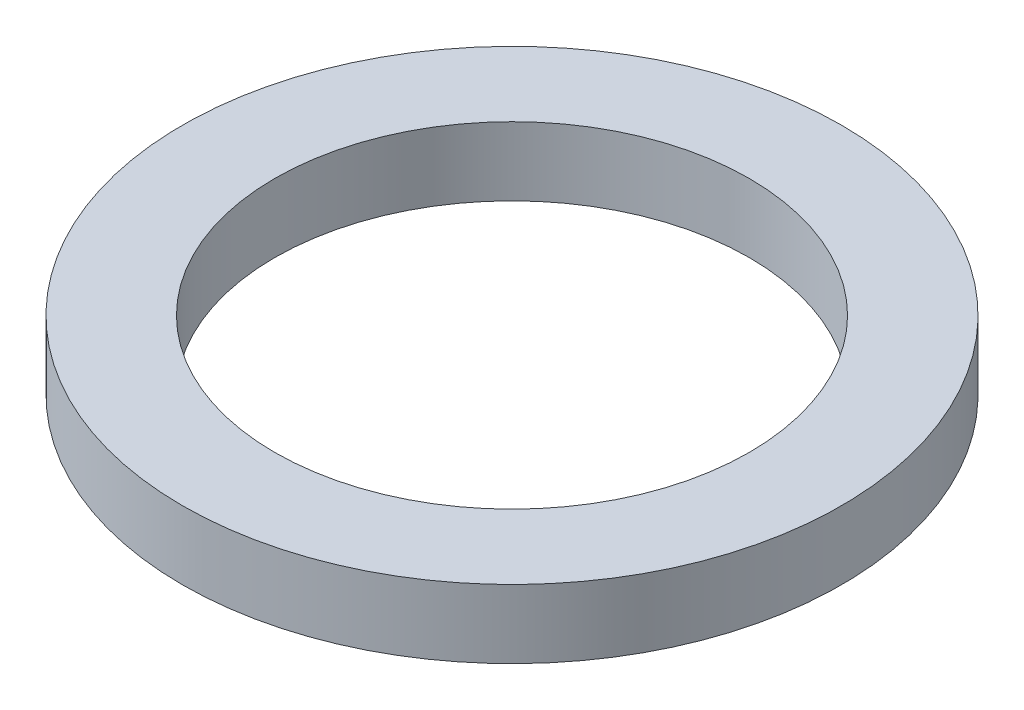
ISO-10303-21;
HEADER;
FILE_DESCRIPTION(('STEP AP214'),'2;1');
FILE_NAME('part.step','',(''),(''),'','','');
FILE_SCHEMA(('AUTOMOTIVE_DESIGN { 1 0 10303 214 1 1 1 1 }'));
ENDSEC;
DATA;
#1=APPLICATION_CONTEXT('core data for automotive mechanical design processes');
#2=APPLICATION_PROTOCOL_DEFINITION('international standard','automotive_design',2000,#1);
#3=PRODUCT_CONTEXT('',#1,'mechanical');
#4=PRODUCT('Part','Part','',(#3));
#5=PRODUCT_RELATED_PRODUCT_CATEGORY('part','',(#4));
#6=PRODUCT_DEFINITION_FORMATION('','',#4);
#7=PRODUCT_DEFINITION_CONTEXT('part definition',#1,'design');
#8=PRODUCT_DEFINITION('design','',#6,#7);
#9=PRODUCT_DEFINITION_SHAPE('','',#8);
#10=(LENGTH_UNIT() NAMED_UNIT(*) SI_UNIT(.MILLI.,.METRE.));
#11=(NAMED_UNIT(*) PLANE_ANGLE_UNIT() SI_UNIT($,.RADIAN.));
#12=(NAMED_UNIT(*) SI_UNIT($,.STERADIAN.) SOLID_ANGLE_UNIT());
#13=UNCERTAINTY_MEASURE_WITH_UNIT(LENGTH_MEASURE(1.E-05),#10,'distance_accuracy_value','');
#14=(GEOMETRIC_REPRESENTATION_CONTEXT(3) GLOBAL_UNCERTAINTY_ASSIGNED_CONTEXT((#13)) GLOBAL_UNIT_ASSIGNED_CONTEXT((#10,
#11,#12)) REPRESENTATION_CONTEXT('',''));
#15=CARTESIAN_POINT('',(0.,0.,0.));
#16=DIRECTION('',(0.,0.,1.));
#17=DIRECTION('',(1.,0.,0.));
#18=AXIS2_PLACEMENT_3D('',#15,#16,#17);
#19=CARTESIAN_POINT('',(0.,13.,0.));
#20=DIRECTION('',(0.,-1.,0.));
#21=DIRECTION('',(0.,0.,-1.));
#22=AXIS2_PLACEMENT_3D('',#19,#20,#21);
#23=CYLINDRICAL_SURFACE('',#22,62.5);
#24=CARTESIAN_POINT('',(0.,13.,0.));
#25=DIRECTION('',(0.,1.,0.));
#26=DIRECTION('',(0.,0.,1.));
#27=AXIS2_PLACEMENT_3D('',#24,#25,#26);
#28=CIRCLE('',#27,62.5);
#29=CARTESIAN_POINT('',(0.,13.,-62.5));
#30=VERTEX_POINT('',#29);
#31=EDGE_CURVE('E10',#30,#30,#28,.T.);
#32=CARTESIAN_POINT('',(0.,0.,0.));
#33=DIRECTION('',(0.,1.,0.));
#34=DIRECTION('',(0.,0.,1.));
#35=AXIS2_PLACEMENT_3D('',#32,#33,#34);
#36=CIRCLE('',#35,62.5);
#37=CARTESIAN_POINT('',(0.,0.,-62.5));
#38=VERTEX_POINT('',#37);
#39=EDGE_CURVE('E37',#38,#38,#36,.T.);
#40=CARTESIAN_POINT('',(0.,13.,-62.5));
#41=CARTESIAN_POINT('',(0.,12.8645833333333,-62.5));
#42=CARTESIAN_POINT('',(0.,12.7291666666667,-62.5));
#43=CARTESIAN_POINT('',(0.,12.4583333333333,-62.5));
#44=CARTESIAN_POINT('',(0.,12.3229166666667,-62.5));
#45=CARTESIAN_POINT('',(0.,12.0520833333333,-62.5));
#46=CARTESIAN_POINT('',(0.,11.9166666666667,-62.5));
#47=CARTESIAN_POINT('',(0.,11.6458333333333,-62.5));
#48=CARTESIAN_POINT('',(0.,11.5104166666667,-62.5));
#49=CARTESIAN_POINT('',(0.,11.2395833333333,-62.5));
#50=CARTESIAN_POINT('',(0.,11.1041666666667,-62.5));
#51=CARTESIAN_POINT('',(0.,10.8333333333333,-62.5));
#52=CARTESIAN_POINT('',(0.,10.6979166666667,-62.5));
#53=CARTESIAN_POINT('',(0.,10.4270833333333,-62.5));
#54=CARTESIAN_POINT('',(0.,10.2916666666667,-62.5));
#55=CARTESIAN_POINT('',(0.,10.0208333333333,-62.5));
#56=CARTESIAN_POINT('',(0.,9.88541666666667,-62.5));
#57=CARTESIAN_POINT('',(0.,9.61458333333333,-62.5));
#58=CARTESIAN_POINT('',(0.,9.47916666666667,-62.5));
#59=CARTESIAN_POINT('',(0.,9.20833333333333,-62.5));
#60=CARTESIAN_POINT('',(0.,9.07291666666667,-62.5));
#61=CARTESIAN_POINT('',(0.,8.80208333333333,-62.5));
#62=CARTESIAN_POINT('',(0.,8.66666666666667,-62.5));
#63=CARTESIAN_POINT('',(0.,8.39583333333333,-62.5));
#64=CARTESIAN_POINT('',(0.,8.26041666666667,-62.5));
#65=CARTESIAN_POINT('',(0.,7.98958333333333,-62.5));
#66=CARTESIAN_POINT('',(0.,7.85416666666667,-62.5));
#67=CARTESIAN_POINT('',(0.,7.58333333333333,-62.5));
#68=CARTESIAN_POINT('',(0.,7.44791666666667,-62.5));
#69=CARTESIAN_POINT('',(0.,7.17708333333333,-62.5));
#70=CARTESIAN_POINT('',(0.,7.04166666666667,-62.5));
#71=CARTESIAN_POINT('',(0.,6.77083333333333,-62.5));
#72=CARTESIAN_POINT('',(0.,6.63541666666667,-62.5));
#73=CARTESIAN_POINT('',(0.,6.36458333333333,-62.5));
#74=CARTESIAN_POINT('',(0.,6.22916666666667,-62.5));
#75=CARTESIAN_POINT('',(0.,5.95833333333333,-62.5));
#76=CARTESIAN_POINT('',(0.,5.82291666666667,-62.5));
#77=CARTESIAN_POINT('',(0.,5.55208333333333,-62.5));
#78=CARTESIAN_POINT('',(0.,5.41666666666667,-62.5));
#79=CARTESIAN_POINT('',(0.,5.14583333333333,-62.5));
#80=CARTESIAN_POINT('',(0.,5.01041666666667,-62.5));
#81=CARTESIAN_POINT('',(0.,4.73958333333333,-62.5));
#82=CARTESIAN_POINT('',(0.,4.60416666666667,-62.5));
#83=CARTESIAN_POINT('',(0.,4.33333333333333,-62.5));
#84=CARTESIAN_POINT('',(0.,4.19791666666667,-62.5));
#85=CARTESIAN_POINT('',(0.,3.92708333333333,-62.5));
#86=CARTESIAN_POINT('',(0.,3.79166666666667,-62.5));
#87=CARTESIAN_POINT('',(0.,3.52083333333333,-62.5));
#88=CARTESIAN_POINT('',(0.,3.38541666666667,-62.5));
#89=CARTESIAN_POINT('',(0.,3.11458333333333,-62.5));
#90=CARTESIAN_POINT('',(0.,2.97916666666667,-62.5));
#91=CARTESIAN_POINT('',(0.,2.70833333333333,-62.5));
#92=CARTESIAN_POINT('',(0.,2.57291666666667,-62.5));
#93=CARTESIAN_POINT('',(0.,2.30208333333333,-62.5));
#94=CARTESIAN_POINT('',(0.,2.16666666666667,-62.5));
#95=CARTESIAN_POINT('',(0.,1.89583333333333,-62.5));
#96=CARTESIAN_POINT('',(0.,1.76041666666667,-62.5));
#97=CARTESIAN_POINT('',(0.,1.48958333333333,-62.5));
#98=CARTESIAN_POINT('',(0.,1.35416666666667,-62.5));
#99=CARTESIAN_POINT('',(0.,1.08333333333333,-62.5));
#100=CARTESIAN_POINT('',(0.,0.947916666666667,-62.5));
#101=CARTESIAN_POINT('',(0.,0.677083333333334,-62.5));
#102=CARTESIAN_POINT('',(0.,0.541666666666667,-62.5));
#103=CARTESIAN_POINT('',(0.,0.270833333333334,-62.5));
#104=CARTESIAN_POINT('',(0.,0.135416666666667,-62.5));
#105=CARTESIAN_POINT('',(0.,0.,-62.5));
#106=B_SPLINE_CURVE_WITH_KNOTS('',3,(#40,#41,#42,#43,#44,#45,#46,#47,#48,#49,#50,#51,#52,#53,
#54,#55,#56,#57,#58,#59,#60,#61,#62,#63,#64,#65,#66,#67,#68,#69,#70,#71,#72,#73,#74,#75,#76,#77,
#78,#79,#80,#81,#82,#83,#84,#85,#86,#87,#88,#89,#90,#91,#92,#93,#94,#95,#96,#97,#98,#99,#100,
#101,#102,#103,#104,#105),.UNSPECIFIED.,.F.,.F.,(4,2,2,2,2,2,2,2,2,2,2,2,2,2,2,2,2,2,2,2,2,2,2,
2,2,2,2,2,2,2,2,2,4),(0.,0.406249999999999,0.812499999999999,1.21875,1.625,2.03125,2.4375,
2.84375,3.25,3.65625,4.0625,4.46875,4.875,5.28125,5.6875,6.09375,6.5,6.90625,7.3125,7.71875,
8.125,8.53125,8.9375,9.34375,9.75,10.15625,10.5625,10.96875,11.375,11.78125,12.1875,12.59375,
13.),.UNSPECIFIED.);
#107=EDGE_CURVE('BSEAM40',#30,#38,#106,.T.);
#108=ORIENTED_EDGE('',*,*,#31,.F.);
#109=ORIENTED_EDGE('',*,*,#39,.T.);
#110=ORIENTED_EDGE('',*,*,#107,.T.);
#111=ORIENTED_EDGE('',*,*,#107,.F.);
#112=EDGE_LOOP('',(#108,#110,#109,#111));
#113=FACE_BOUND('',#112,.T.);
#114=ADVANCED_FACE('F40',(#113),#23,.T.);
#115=CARTESIAN_POINT('',(0.,13.,0.));
#116=DIRECTION('',(0.,1.,0.));
#117=DIRECTION('',(0.,0.,1.));
#118=AXIS2_PLACEMENT_3D('',#115,#116,#117);
#119=PLANE('',#118);
#120=CARTESIAN_POINT('',(0.,13.,0.));
#121=DIRECTION('',(0.,1.,0.));
#122=DIRECTION('',(0.,0.,1.));
#123=AXIS2_PLACEMENT_3D('',#120,#121,#122);
#124=CIRCLE('',#123,45.);
#125=CARTESIAN_POINT('',(0.,13.,-45.));
#126=VERTEX_POINT('',#125);
#127=EDGE_CURVE('E50',#126,#126,#124,.T.);
#128=ORIENTED_EDGE('',*,*,#127,.F.);
#129=EDGE_LOOP('',(#128));
#130=FACE_BOUND('',#129,.T.);
#131=ORIENTED_EDGE('',*,*,#31,.T.);
#132=EDGE_LOOP('',(#131));
#133=FACE_BOUND('',#132,.T.);
#134=ADVANCED_FACE('F59',(#130,#133),#119,.T.);
#135=CARTESIAN_POINT('',(0.,0.,0.));
#136=DIRECTION('',(0.,1.,0.));
#137=DIRECTION('',(0.,0.,1.));
#138=AXIS2_PLACEMENT_3D('',#135,#136,#137);
#139=PLANE('',#138);
#140=CARTESIAN_POINT('',(0.,0.,0.));
#141=DIRECTION('',(0.,1.,0.));
#142=DIRECTION('',(0.,0.,1.));
#143=AXIS2_PLACEMENT_3D('',#140,#141,#142);
#144=CIRCLE('',#143,45.);
#145=CARTESIAN_POINT('',(0.,0.,-45.));
#146=VERTEX_POINT('',#145);
#147=EDGE_CURVE('E47',#146,#146,#144,.T.);
#148=ORIENTED_EDGE('',*,*,#147,.T.);
#149=EDGE_LOOP('',(#148));
#150=FACE_BOUND('',#149,.T.);
#151=ORIENTED_EDGE('',*,*,#39,.F.);
#152=EDGE_LOOP('',(#151));
#153=FACE_BOUND('',#152,.T.);
#154=ADVANCED_FACE('F58',(#150,#153),#139,.F.);
#155=CARTESIAN_POINT('',(0.,13.,0.));
#156=DIRECTION('',(0.,-1.,0.));
#157=DIRECTION('',(0.,0.,-1.));
#158=AXIS2_PLACEMENT_3D('',#155,#156,#157);
#159=CYLINDRICAL_SURFACE('',#158,45.);
#160=CARTESIAN_POINT('',(0.,13.,-45.));
#161=CARTESIAN_POINT('',(0.,12.8645833333333,-45.));
#162=CARTESIAN_POINT('',(0.,12.7291666666667,-45.));
#163=CARTESIAN_POINT('',(0.,12.4583333333333,-45.));
#164=CARTESIAN_POINT('',(0.,12.3229166666667,-45.));
#165=CARTESIAN_POINT('',(0.,12.0520833333333,-45.));
#166=CARTESIAN_POINT('',(0.,11.9166666666667,-45.));
#167=CARTESIAN_POINT('',(0.,11.6458333333333,-45.));
#168=CARTESIAN_POINT('',(0.,11.5104166666667,-45.));
#169=CARTESIAN_POINT('',(0.,11.2395833333333,-45.));
#170=CARTESIAN_POINT('',(0.,11.1041666666667,-45.));
#171=CARTESIAN_POINT('',(0.,10.8333333333333,-45.));
#172=CARTESIAN_POINT('',(0.,10.6979166666667,-45.));
#173=CARTESIAN_POINT('',(0.,10.4270833333333,-45.));
#174=CARTESIAN_POINT('',(0.,10.2916666666667,-45.));
#175=CARTESIAN_POINT('',(0.,10.0208333333333,-45.));
#176=CARTESIAN_POINT('',(0.,9.88541666666667,-45.));
#177=CARTESIAN_POINT('',(0.,9.61458333333333,-45.));
#178=CARTESIAN_POINT('',(0.,9.47916666666667,-45.));
#179=CARTESIAN_POINT('',(0.,9.20833333333333,-45.));
#180=CARTESIAN_POINT('',(0.,9.07291666666666,-45.));
#181=CARTESIAN_POINT('',(0.,8.80208333333333,-45.));
#182=CARTESIAN_POINT('',(0.,8.66666666666667,-45.));
#183=CARTESIAN_POINT('',(0.,8.39583333333333,-45.));
#184=CARTESIAN_POINT('',(0.,8.26041666666667,-45.));
#185=CARTESIAN_POINT('',(0.,7.98958333333333,-45.));
#186=CARTESIAN_POINT('',(0.,7.85416666666667,-45.));
#187=CARTESIAN_POINT('',(0.,7.58333333333333,-45.));
#188=CARTESIAN_POINT('',(0.,7.44791666666667,-45.));
#189=CARTESIAN_POINT('',(0.,7.17708333333333,-45.));
#190=CARTESIAN_POINT('',(0.,7.04166666666667,-45.));
#191=CARTESIAN_POINT('',(0.,6.77083333333333,-45.));
#192=CARTESIAN_POINT('',(0.,6.63541666666667,-45.));
#193=CARTESIAN_POINT('',(0.,6.36458333333333,-45.));
#194=CARTESIAN_POINT('',(0.,6.22916666666667,-45.));
#195=CARTESIAN_POINT('',(0.,5.95833333333333,-45.));
#196=CARTESIAN_POINT('',(0.,5.82291666666667,-45.));
#197=CARTESIAN_POINT('',(0.,5.55208333333333,-45.));
#198=CARTESIAN_POINT('',(0.,5.41666666666667,-45.));
#199=CARTESIAN_POINT('',(0.,5.14583333333333,-45.));
#200=CARTESIAN_POINT('',(0.,5.01041666666667,-45.));
#201=CARTESIAN_POINT('',(0.,4.73958333333333,-45.));
#202=CARTESIAN_POINT('',(0.,4.60416666666667,-45.));
#203=CARTESIAN_POINT('',(0.,4.33333333333333,-45.));
#204=CARTESIAN_POINT('',(0.,4.19791666666667,-45.));
#205=CARTESIAN_POINT('',(0.,3.92708333333333,-45.));
#206=CARTESIAN_POINT('',(0.,3.79166666666667,-45.));
#207=CARTESIAN_POINT('',(0.,3.52083333333333,-45.));
#208=CARTESIAN_POINT('',(0.,3.38541666666667,-45.));
#209=CARTESIAN_POINT('',(0.,3.11458333333333,-45.));
#210=CARTESIAN_POINT('',(0.,2.97916666666667,-45.));
#211=CARTESIAN_POINT('',(0.,2.70833333333333,-45.));
#212=CARTESIAN_POINT('',(0.,2.57291666666667,-45.));
#213=CARTESIAN_POINT('',(0.,2.30208333333333,-45.));
#214=CARTESIAN_POINT('',(0.,2.16666666666667,-45.));
#215=CARTESIAN_POINT('',(0.,1.89583333333333,-45.));
#216=CARTESIAN_POINT('',(0.,1.76041666666667,-45.));
#217=CARTESIAN_POINT('',(0.,1.48958333333333,-45.));
#218=CARTESIAN_POINT('',(0.,1.35416666666667,-45.));
#219=CARTESIAN_POINT('',(0.,1.08333333333333,-45.));
#220=CARTESIAN_POINT('',(0.,0.947916666666667,-45.));
#221=CARTESIAN_POINT('',(0.,0.677083333333334,-45.));
#222=CARTESIAN_POINT('',(0.,0.541666666666667,-45.));
#223=CARTESIAN_POINT('',(0.,0.270833333333334,-45.));
#224=CARTESIAN_POINT('',(0.,0.135416666666667,-45.));
#225=CARTESIAN_POINT('',(0.,0.,-45.));
#226=B_SPLINE_CURVE_WITH_KNOTS('',3,(#160,#161,#162,#163,#164,#165,#166,#167,#168,#169,#170,
#171,#172,#173,#174,#175,#176,#177,#178,#179,#180,#181,#182,#183,#184,#185,#186,#187,#188,#189,
#190,#191,#192,#193,#194,#195,#196,#197,#198,#199,#200,#201,#202,#203,#204,#205,#206,#207,#208,
#209,#210,#211,#212,#213,#214,#215,#216,#217,#218,#219,#220,#221,#222,#223,#224,#225),
.UNSPECIFIED.,.F.,.F.,(4,2,2,2,2,2,2,2,2,2,2,2,2,2,2,2,2,2,2,2,2,2,2,2,2,2,2,2,2,2,2,2,4),(0.,
0.40625,0.812500000000001,1.21875,1.625,2.03125,2.4375,2.84375,3.25,3.65625,4.0625,4.46875,
4.875,5.28125,5.6875,6.09375,6.5,6.90625,7.3125,7.71875,8.125,8.53125,8.9375,9.34375,9.75,
10.15625,10.5625,10.96875,11.375,11.78125,12.1875,12.59375,13.),.UNSPECIFIED.);
#227=EDGE_CURVE('BSEAM54',#126,#146,#226,.T.);
#228=ORIENTED_EDGE('',*,*,#127,.T.);
#229=ORIENTED_EDGE('',*,*,#147,.F.);
#230=ORIENTED_EDGE('',*,*,#227,.T.);
#231=ORIENTED_EDGE('',*,*,#227,.F.);
#232=EDGE_LOOP('',(#228,#230,#229,#231));
#233=FACE_BOUND('',#232,.T.);
#234=ADVANCED_FACE('F54',(#233),#159,.F.);
#235=CLOSED_SHELL('',(#114,#134,#154,#234));
#236=MANIFOLD_SOLID_BREP('B2',#235);
#237=ADVANCED_BREP_SHAPE_REPRESENTATION('',(#18,#236),#14);
#238=SHAPE_DEFINITION_REPRESENTATION(#9,#237);
ENDSEC;
END-ISO-10303-21;
